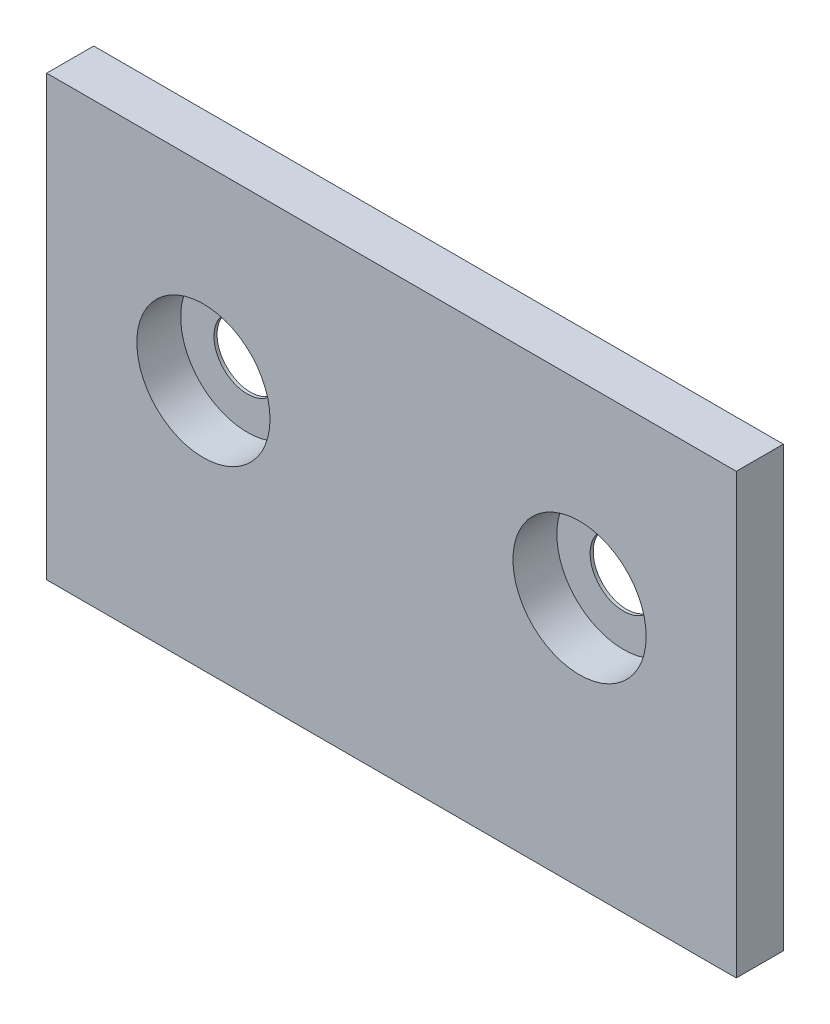
ISO-10303-21;
HEADER;
FILE_DESCRIPTION(('STEP AP214'),'2;1');
FILE_NAME('part.step','',(''),(''),'','','');
FILE_SCHEMA(('AUTOMOTIVE_DESIGN { 1 0 10303 214 1 1 1 1 }'));
ENDSEC;
DATA;
#1=APPLICATION_CONTEXT('core data for automotive mechanical design processes');
#2=APPLICATION_PROTOCOL_DEFINITION('international standard','automotive_design',2000,#1);
#3=PRODUCT_CONTEXT('',#1,'mechanical');
#4=PRODUCT('Part','Part','',(#3));
#5=PRODUCT_RELATED_PRODUCT_CATEGORY('part','',(#4));
#6=PRODUCT_DEFINITION_FORMATION('','',#4);
#7=PRODUCT_DEFINITION_CONTEXT('part definition',#1,'design');
#8=PRODUCT_DEFINITION('design','',#6,#7);
#9=PRODUCT_DEFINITION_SHAPE('','',#8);
#10=(LENGTH_UNIT() NAMED_UNIT(*) SI_UNIT(.MILLI.,.METRE.));
#11=(NAMED_UNIT(*) PLANE_ANGLE_UNIT() SI_UNIT($,.RADIAN.));
#12=(NAMED_UNIT(*) SI_UNIT($,.STERADIAN.) SOLID_ANGLE_UNIT());
#13=UNCERTAINTY_MEASURE_WITH_UNIT(LENGTH_MEASURE(1.E-05),#10,'distance_accuracy_value','');
#14=(GEOMETRIC_REPRESENTATION_CONTEXT(3) GLOBAL_UNCERTAINTY_ASSIGNED_CONTEXT((#13)) GLOBAL_UNIT_ASSIGNED_CONTEXT((#10,
#11,#12)) REPRESENTATION_CONTEXT('',''));
#15=CARTESIAN_POINT('',(0.,0.,0.));
#16=DIRECTION('',(0.,0.,1.));
#17=DIRECTION('',(1.,0.,0.));
#18=AXIS2_PLACEMENT_3D('',#15,#16,#17);
#19=CARTESIAN_POINT('',(34.925,39.6875,4.7625));
#20=DIRECTION('',(-1.,0.,0.));
#21=DIRECTION('',(0.,0.,1.));
#22=AXIS2_PLACEMENT_3D('',#19,#20,#21);
#23=PLANE('',#22);
#24=DIRECTION('',(0.,1.,0.));
#25=VECTOR('',#24,1.);
#26=CARTESIAN_POINT('',(34.925,39.6875,0.));
#27=LINE('',#26,#25);
#28=CARTESIAN_POINT('',(34.925,39.6875,0.));
#29=VERTEX_POINT('',#28);
#30=CARTESIAN_POINT('',(34.925,84.1375,0.));
#31=VERTEX_POINT('',#30);
#32=EDGE_CURVE('E95',#29,#31,#27,.T.);
#33=ORIENTED_EDGE('',*,*,#32,.T.);
#34=DIRECTION('',(0.,0.,-1.));
#35=VECTOR('',#34,1.);
#36=CARTESIAN_POINT('',(34.925,84.1375,4.7625));
#37=LINE('',#36,#35);
#38=CARTESIAN_POINT('',(34.925,84.1375,4.7625));
#39=VERTEX_POINT('',#38);
#40=EDGE_CURVE('E11',#39,#31,#37,.T.);
#41=ORIENTED_EDGE('',*,*,#40,.F.);
#42=DIRECTION('',(0.,1.,0.));
#43=VECTOR('',#42,1.);
#44=CARTESIAN_POINT('',(34.925,39.6875,4.7625));
#45=LINE('',#44,#43);
#46=CARTESIAN_POINT('',(34.925,39.6875,4.7625));
#47=VERTEX_POINT('',#46);
#48=EDGE_CURVE('E83',#47,#39,#45,.T.);
#49=ORIENTED_EDGE('',*,*,#48,.F.);
#50=DIRECTION('',(0.,0.,-1.));
#51=VECTOR('',#50,1.);
#52=CARTESIAN_POINT('',(34.925,39.6875,4.7625));
#53=LINE('',#52,#51);
#54=EDGE_CURVE('E91',#47,#29,#53,.T.);
#55=ORIENTED_EDGE('',*,*,#54,.T.);
#56=EDGE_LOOP('',(#33,#41,#49,#55));
#57=FACE_BOUND('',#56,.T.);
#58=ADVANCED_FACE('F32',(#57),#23,.F.);
#59=CARTESIAN_POINT('',(34.925,84.1375,4.7625));
#60=DIRECTION('',(0.,-1.,0.));
#61=DIRECTION('',(0.,0.,-1.));
#62=AXIS2_PLACEMENT_3D('',#59,#60,#61);
#63=PLANE('',#62);
#64=DIRECTION('',(-1.,0.,0.));
#65=VECTOR('',#64,1.);
#66=CARTESIAN_POINT('',(34.925,84.1375,0.));
#67=LINE('',#66,#65);
#68=CARTESIAN_POINT('',(-34.925,84.1375,0.));
#69=VERTEX_POINT('',#68);
#70=EDGE_CURVE('E87',#31,#69,#67,.T.);
#71=ORIENTED_EDGE('',*,*,#70,.T.);
#72=DIRECTION('',(0.,0.,-1.));
#73=VECTOR('',#72,1.);
#74=CARTESIAN_POINT('',(-34.925,84.1375,4.7625));
#75=LINE('',#74,#73);
#76=CARTESIAN_POINT('',(-34.925,84.1375,4.7625));
#77=VERTEX_POINT('',#76);
#78=EDGE_CURVE('E40',#77,#69,#75,.T.);
#79=ORIENTED_EDGE('',*,*,#78,.F.);
#80=DIRECTION('',(-1.,0.,0.));
#81=VECTOR('',#80,1.);
#82=CARTESIAN_POINT('',(34.925,84.1375,4.7625));
#83=LINE('',#82,#81);
#84=EDGE_CURVE('E78',#39,#77,#83,.T.);
#85=ORIENTED_EDGE('',*,*,#84,.F.);
#86=ORIENTED_EDGE('',*,*,#40,.T.);
#87=EDGE_LOOP('',(#71,#79,#85,#86));
#88=FACE_BOUND('',#87,.T.);
#89=ADVANCED_FACE('F86',(#88),#63,.F.);
#90=CARTESIAN_POINT('',(-34.925,84.1375,4.7625));
#91=DIRECTION('',(1.,0.,0.));
#92=DIRECTION('',(0.,0.,-1.));
#93=AXIS2_PLACEMENT_3D('',#90,#91,#92);
#94=PLANE('',#93);
#95=DIRECTION('',(0.,-1.,0.));
#96=VECTOR('',#95,1.);
#97=CARTESIAN_POINT('',(-34.925,84.1375,0.));
#98=LINE('',#97,#96);
#99=CARTESIAN_POINT('',(-34.925,39.6875,0.));
#100=VERTEX_POINT('',#99);
#101=EDGE_CURVE('E65',#69,#100,#98,.T.);
#102=ORIENTED_EDGE('',*,*,#101,.T.);
#103=DIRECTION('',(0.,0.,-1.));
#104=VECTOR('',#103,1.);
#105=CARTESIAN_POINT('',(-34.925,39.6875,4.7625));
#106=LINE('',#105,#104);
#107=CARTESIAN_POINT('',(-34.925,39.6875,4.7625));
#108=VERTEX_POINT('',#107);
#109=EDGE_CURVE('E88',#108,#100,#106,.T.);
#110=ORIENTED_EDGE('',*,*,#109,.F.);
#111=DIRECTION('',(0.,-1.,0.));
#112=VECTOR('',#111,1.);
#113=CARTESIAN_POINT('',(-34.925,84.1375,4.7625));
#114=LINE('',#113,#112);
#115=EDGE_CURVE('E81',#77,#108,#114,.T.);
#116=ORIENTED_EDGE('',*,*,#115,.F.);
#117=ORIENTED_EDGE('',*,*,#78,.T.);
#118=EDGE_LOOP('',(#102,#110,#116,#117));
#119=FACE_BOUND('',#118,.T.);
#120=ADVANCED_FACE('F89',(#119),#94,.F.);
#121=CARTESIAN_POINT('',(-34.925,39.6875,4.7625));
#122=DIRECTION('',(0.,1.,0.));
#123=DIRECTION('',(0.,0.,1.));
#124=AXIS2_PLACEMENT_3D('',#121,#122,#123);
#125=PLANE('',#124);
#126=DIRECTION('',(1.,0.,0.));
#127=VECTOR('',#126,1.);
#128=CARTESIAN_POINT('',(-34.925,39.6875,0.));
#129=LINE('',#128,#127);
#130=EDGE_CURVE('E71',#100,#29,#129,.T.);
#131=ORIENTED_EDGE('',*,*,#130,.T.);
#132=ORIENTED_EDGE('',*,*,#54,.F.);
#133=DIRECTION('',(1.,0.,0.));
#134=VECTOR('',#133,1.);
#135=CARTESIAN_POINT('',(-34.925,39.6875,4.7625));
#136=LINE('',#135,#134);
#137=EDGE_CURVE('E48',#108,#47,#136,.T.);
#138=ORIENTED_EDGE('',*,*,#137,.F.);
#139=ORIENTED_EDGE('',*,*,#109,.T.);
#140=EDGE_LOOP('',(#131,#132,#138,#139));
#141=FACE_BOUND('',#140,.T.);
#142=ADVANCED_FACE('F103',(#141),#125,.F.);
#143=CARTESIAN_POINT('',(34.925,84.1375,4.7625));
#144=DIRECTION('',(0.,0.,1.));
#145=DIRECTION('',(1.,0.,0.));
#146=AXIS2_PLACEMENT_3D('',#143,#144,#145);
#147=PLANE('',#146);
#148=CARTESIAN_POINT('',(-19.05,65.0875,4.7625));
#149=DIRECTION('',(0.,0.,1.));
#150=DIRECTION('',(1.,0.,0.));
#151=AXIS2_PLACEMENT_3D('',#148,#149,#150);
#152=CIRCLE('',#151,6.74624);
#153=CARTESIAN_POINT('',(-12.30376,65.0875,4.7625));
#154=VERTEX_POINT('',#153);
#155=EDGE_CURVE('E129',#154,#154,#152,.T.);
#156=ORIENTED_EDGE('',*,*,#155,.F.);
#157=EDGE_LOOP('',(#156));
#158=FACE_BOUND('',#157,.T.);
#159=CARTESIAN_POINT('',(19.05,65.0875,4.7625));
#160=DIRECTION('',(0.,0.,1.));
#161=DIRECTION('',(1.,0.,0.));
#162=AXIS2_PLACEMENT_3D('',#159,#160,#161);
#163=CIRCLE('',#162,6.74624);
#164=CARTESIAN_POINT('',(25.79624,65.0875,4.7625));
#165=VERTEX_POINT('',#164);
#166=EDGE_CURVE('E117',#165,#165,#163,.T.);
#167=ORIENTED_EDGE('',*,*,#166,.F.);
#168=EDGE_LOOP('',(#167));
#169=FACE_BOUND('',#168,.T.);
#170=ORIENTED_EDGE('',*,*,#48,.T.);
#171=ORIENTED_EDGE('',*,*,#84,.T.);
#172=ORIENTED_EDGE('',*,*,#115,.T.);
#173=ORIENTED_EDGE('',*,*,#137,.T.);
#174=EDGE_LOOP('',(#170,#171,#172,#173));
#175=FACE_BOUND('',#174,.T.);
#176=ADVANCED_FACE('F79',(#158,#169,#175),#147,.T.);
#177=CARTESIAN_POINT('',(34.925,84.1375,0.));
#178=DIRECTION('',(0.,0.,1.));
#179=DIRECTION('',(1.,0.,0.));
#180=AXIS2_PLACEMENT_3D('',#177,#178,#179);
#181=PLANE('',#180);
#182=CARTESIAN_POINT('',(-19.05,65.0875,0.));
#183=DIRECTION('',(0.,0.,1.));
#184=DIRECTION('',(1.,0.,0.));
#185=AXIS2_PLACEMENT_3D('',#182,#183,#184);
#186=CIRCLE('',#185,3.3782);
#187=CARTESIAN_POINT('',(-15.6718,65.0875,0.));
#188=VERTEX_POINT('',#187);
#189=EDGE_CURVE('E120',#188,#188,#186,.T.);
#190=ORIENTED_EDGE('',*,*,#189,.T.);
#191=EDGE_LOOP('',(#190));
#192=FACE_BOUND('',#191,.T.);
#193=CARTESIAN_POINT('',(19.05,65.0875,0.));
#194=DIRECTION('',(0.,0.,1.));
#195=DIRECTION('',(1.,0.,0.));
#196=AXIS2_PLACEMENT_3D('',#193,#194,#195);
#197=CIRCLE('',#196,3.3782);
#198=CARTESIAN_POINT('',(22.4282,65.0875,0.));
#199=VERTEX_POINT('',#198);
#200=EDGE_CURVE('E98',#199,#199,#197,.T.);
#201=ORIENTED_EDGE('',*,*,#200,.T.);
#202=EDGE_LOOP('',(#201));
#203=FACE_BOUND('',#202,.T.);
#204=ORIENTED_EDGE('',*,*,#32,.F.);
#205=ORIENTED_EDGE('',*,*,#130,.F.);
#206=ORIENTED_EDGE('',*,*,#101,.F.);
#207=ORIENTED_EDGE('',*,*,#70,.F.);
#208=EDGE_LOOP('',(#204,#205,#206,#207));
#209=FACE_BOUND('',#208,.T.);
#210=ADVANCED_FACE('F106',(#192,#203,#209),#181,.F.);
#211=CARTESIAN_POINT('',(19.05,65.0875,4.7625));
#212=DIRECTION('',(0.,0.,1.));
#213=DIRECTION('',(1.,0.,0.));
#214=AXIS2_PLACEMENT_3D('',#211,#212,#213);
#215=CYLINDRICAL_SURFACE('',#214,3.3782);
#216=ORIENTED_EDGE('',*,*,#200,.F.);
#217=EDGE_LOOP('',(#216));
#218=FACE_BOUND('',#217,.T.);
#219=CARTESIAN_POINT('',(19.05,65.0875,0.317500000000001));
#220=DIRECTION('',(0.,0.,1.));
#221=DIRECTION('',(1.,0.,0.));
#222=AXIS2_PLACEMENT_3D('',#219,#220,#221);
#223=CIRCLE('',#222,3.3782);
#224=CARTESIAN_POINT('',(22.4282,65.0875,0.317500000000001));
#225=VERTEX_POINT('',#224);
#226=EDGE_CURVE('E111',#225,#225,#223,.T.);
#227=ORIENTED_EDGE('',*,*,#226,.T.);
#228=EDGE_LOOP('',(#227));
#229=FACE_BOUND('',#228,.T.);
#230=ADVANCED_FACE('F153',(#218,#229),#215,.F.);
#231=CARTESIAN_POINT('',(22.4282,65.0875,0.317500000000001));
#232=DIRECTION('',(0.,0.,-1.));
#233=DIRECTION('',(-1.,0.,0.));
#234=AXIS2_PLACEMENT_3D('',#231,#232,#233);
#235=PLANE('',#234);
#236=ORIENTED_EDGE('',*,*,#226,.F.);
#237=EDGE_LOOP('',(#236));
#238=FACE_BOUND('',#237,.T.);
#239=CARTESIAN_POINT('',(19.05,65.0875,0.317500000000001));
#240=DIRECTION('',(0.,0.,1.));
#241=DIRECTION('',(1.,0.,0.));
#242=AXIS2_PLACEMENT_3D('',#239,#240,#241);
#243=CIRCLE('',#242,6.74624);
#244=CARTESIAN_POINT('',(25.79624,65.0875,0.317500000000001));
#245=VERTEX_POINT('',#244);
#246=EDGE_CURVE('E114',#245,#245,#243,.T.);
#247=ORIENTED_EDGE('',*,*,#246,.T.);
#248=EDGE_LOOP('',(#247));
#249=FACE_BOUND('',#248,.T.);
#250=ADVANCED_FACE('F143',(#238,#249),#235,.F.);
#251=CARTESIAN_POINT('',(19.05,65.0875,4.7625));
#252=DIRECTION('',(0.,0.,1.));
#253=DIRECTION('',(1.,0.,0.));
#254=AXIS2_PLACEMENT_3D('',#251,#252,#253);
#255=CYLINDRICAL_SURFACE('',#254,6.74624);
#256=ORIENTED_EDGE('',*,*,#246,.F.);
#257=EDGE_LOOP('',(#256));
#258=FACE_BOUND('',#257,.T.);
#259=ORIENTED_EDGE('',*,*,#166,.T.);
#260=EDGE_LOOP('',(#259));
#261=FACE_BOUND('',#260,.T.);
#262=ADVANCED_FACE('F140',(#258,#261),#255,.F.);
#263=CARTESIAN_POINT('',(-19.05,65.0875,4.7625));
#264=DIRECTION('',(0.,0.,1.));
#265=DIRECTION('',(1.,0.,0.));
#266=AXIS2_PLACEMENT_3D('',#263,#264,#265);
#267=CYLINDRICAL_SURFACE('',#266,3.3782);
#268=ORIENTED_EDGE('',*,*,#189,.F.);
#269=EDGE_LOOP('',(#268));
#270=FACE_BOUND('',#269,.T.);
#271=CARTESIAN_POINT('',(-19.05,65.0875,0.317500000000001));
#272=DIRECTION('',(0.,0.,1.));
#273=DIRECTION('',(1.,0.,0.));
#274=AXIS2_PLACEMENT_3D('',#271,#272,#273);
#275=CIRCLE('',#274,3.3782);
#276=CARTESIAN_POINT('',(-15.6718,65.0875,0.317500000000001));
#277=VERTEX_POINT('',#276);
#278=EDGE_CURVE('E123',#277,#277,#275,.T.);
#279=ORIENTED_EDGE('',*,*,#278,.T.);
#280=EDGE_LOOP('',(#279));
#281=FACE_BOUND('',#280,.T.);
#282=ADVANCED_FACE('F142',(#270,#281),#267,.F.);
#283=CARTESIAN_POINT('',(-15.6718,65.0875,0.317500000000001));
#284=DIRECTION('',(0.,0.,-1.));
#285=DIRECTION('',(-1.,0.,0.));
#286=AXIS2_PLACEMENT_3D('',#283,#284,#285);
#287=PLANE('',#286);
#288=ORIENTED_EDGE('',*,*,#278,.F.);
#289=EDGE_LOOP('',(#288));
#290=FACE_BOUND('',#289,.T.);
#291=CARTESIAN_POINT('',(-19.05,65.0875,0.317500000000001));
#292=DIRECTION('',(0.,0.,1.));
#293=DIRECTION('',(1.,0.,0.));
#294=AXIS2_PLACEMENT_3D('',#291,#292,#293);
#295=CIRCLE('',#294,6.74624);
#296=CARTESIAN_POINT('',(-12.30376,65.0875,0.317500000000001));
#297=VERTEX_POINT('',#296);
#298=EDGE_CURVE('E126',#297,#297,#295,.T.);
#299=ORIENTED_EDGE('',*,*,#298,.T.);
#300=EDGE_LOOP('',(#299));
#301=FACE_BOUND('',#300,.T.);
#302=ADVANCED_FACE('F150',(#290,#301),#287,.F.);
#303=CARTESIAN_POINT('',(-19.05,65.0875,4.7625));
#304=DIRECTION('',(0.,0.,1.));
#305=DIRECTION('',(1.,0.,0.));
#306=AXIS2_PLACEMENT_3D('',#303,#304,#305);
#307=CYLINDRICAL_SURFACE('',#306,6.74624);
#308=ORIENTED_EDGE('',*,*,#298,.F.);
#309=EDGE_LOOP('',(#308));
#310=FACE_BOUND('',#309,.T.);
#311=ORIENTED_EDGE('',*,*,#155,.T.);
#312=EDGE_LOOP('',(#311));
#313=FACE_BOUND('',#312,.T.);
#314=ADVANCED_FACE('F133',(#310,#313),#307,.F.);
#315=CLOSED_SHELL('',(#58,#89,#120,#142,#176,#210,#230,#250,#262,#282,#302,#314));
#316=MANIFOLD_SOLID_BREP('B2',#315);
#317=ADVANCED_BREP_SHAPE_REPRESENTATION('',(#18,#316),#14);
#318=SHAPE_DEFINITION_REPRESENTATION(#9,#317);
ENDSEC;
END-ISO-10303-21;
